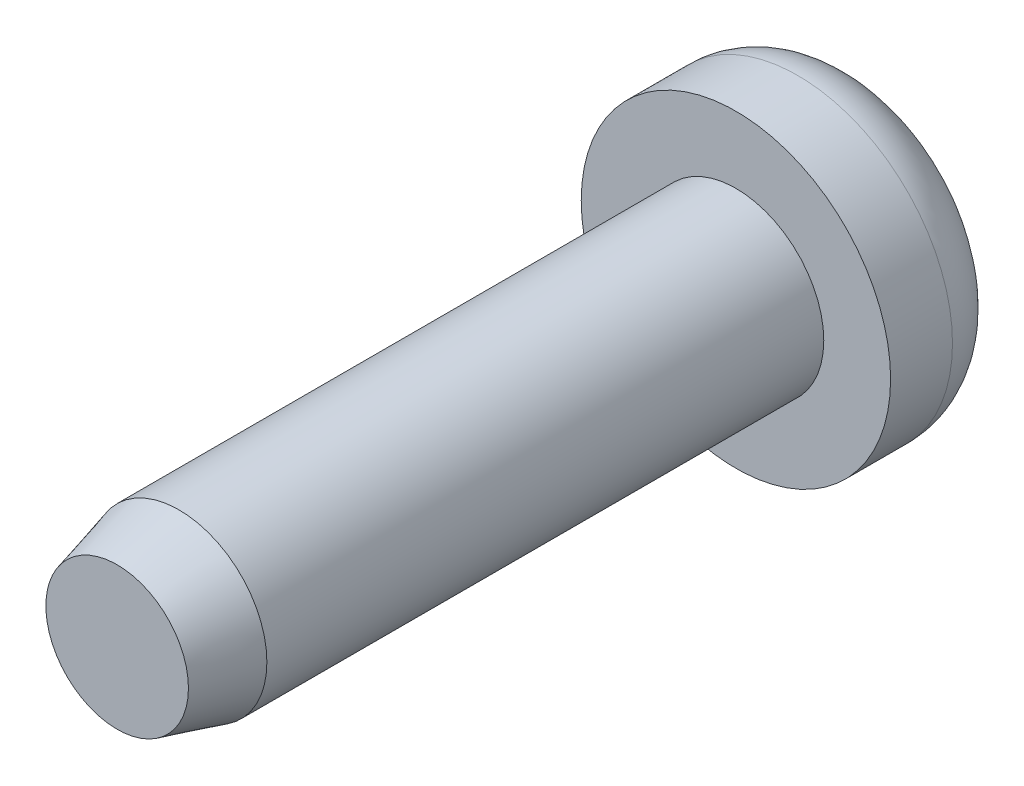
ISO-10303-21;
HEADER;
FILE_DESCRIPTION(('STEP AP214'),'2;1');
FILE_NAME('part.step','',(''),(''),'','','');
FILE_SCHEMA(('AUTOMOTIVE_DESIGN { 1 0 10303 214 1 1 1 1 }'));
ENDSEC;
DATA;
#1=APPLICATION_CONTEXT('core data for automotive mechanical design processes');
#2=APPLICATION_PROTOCOL_DEFINITION('international standard','automotive_design',2000,#1);
#3=PRODUCT_CONTEXT('',#1,'mechanical');
#4=PRODUCT('Part','Part','',(#3));
#5=PRODUCT_RELATED_PRODUCT_CATEGORY('part','',(#4));
#6=PRODUCT_DEFINITION_FORMATION('','',#4);
#7=PRODUCT_DEFINITION_CONTEXT('part definition',#1,'design');
#8=PRODUCT_DEFINITION('design','',#6,#7);
#9=PRODUCT_DEFINITION_SHAPE('','',#8);
#10=(LENGTH_UNIT() NAMED_UNIT(*) SI_UNIT(.MILLI.,.METRE.));
#11=(NAMED_UNIT(*) PLANE_ANGLE_UNIT() SI_UNIT($,.RADIAN.));
#12=(NAMED_UNIT(*) SI_UNIT($,.STERADIAN.) SOLID_ANGLE_UNIT());
#13=UNCERTAINTY_MEASURE_WITH_UNIT(LENGTH_MEASURE(1.E-05),#10,'distance_accuracy_value','');
#14=(GEOMETRIC_REPRESENTATION_CONTEXT(3) GLOBAL_UNCERTAINTY_ASSIGNED_CONTEXT((#13)) GLOBAL_UNIT_ASSIGNED_CONTEXT((#10,
#11,#12)) REPRESENTATION_CONTEXT('',''));
#15=CARTESIAN_POINT('',(0.,0.,0.));
#16=DIRECTION('',(0.,0.,1.));
#17=DIRECTION('',(1.,0.,0.));
#18=AXIS2_PLACEMENT_3D('',#15,#16,#17);
#19=CARTESIAN_POINT('',(0.,0.,6.35));
#20=DIRECTION('',(0.,0.,-1.));
#21=DIRECTION('',(-1.,0.,0.));
#22=AXIS2_PLACEMENT_3D('',#19,#20,#21);
#23=CYLINDRICAL_SURFACE('',#22,1.8034);
#24=CARTESIAN_POINT('',(0.,0.,5.07999999999999));
#25=DIRECTION('',(0.,0.,1.));
#26=DIRECTION('',(1.,0.,0.));
#27=AXIS2_PLACEMENT_3D('',#24,#25,#26);
#28=CIRCLE('',#27,1.8034);
#29=CARTESIAN_POINT('',(1.8034,0.,5.07999999999999));
#30=VERTEX_POINT('',#29);
#31=EDGE_CURVE('E10',#30,#30,#28,.F.);
#32=ORIENTED_EDGE('',*,*,#31,.T.);
#33=EDGE_LOOP('',(#32));
#34=FACE_BOUND('',#33,.T.);
#35=CARTESIAN_POINT('',(0.,0.,-6.35));
#36=DIRECTION('',(0.,0.,1.));
#37=DIRECTION('',(1.,0.,0.));
#38=AXIS2_PLACEMENT_3D('',#35,#36,#37);
#39=CIRCLE('',#38,1.8034);
#40=CARTESIAN_POINT('',(1.8034,0.,-6.35));
#41=VERTEX_POINT('',#40);
#42=EDGE_CURVE('E43',#41,#41,#39,.T.);
#43=ORIENTED_EDGE('',*,*,#42,.T.);
#44=EDGE_LOOP('',(#43));
#45=FACE_BOUND('',#44,.T.);
#46=ADVANCED_FACE('F32',(#34,#45),#23,.T.);
#47=CARTESIAN_POINT('',(0.,0.,6.35));
#48=DIRECTION('',(0.,0.,1.));
#49=DIRECTION('',(1.,0.,0.));
#50=AXIS2_PLACEMENT_3D('',#47,#48,#49);
#51=PLANE('',#50);
#52=CARTESIAN_POINT('',(0.,0.,6.35));
#53=DIRECTION('',(0.,0.,1.));
#54=DIRECTION('',(1.,0.,0.));
#55=AXIS2_PLACEMENT_3D('',#52,#53,#54);
#56=CIRCLE('',#55,1.46310452561247);
#57=CARTESIAN_POINT('',(1.46310452561247,0.,6.35));
#58=VERTEX_POINT('',#57);
#59=EDGE_CURVE('E39',#58,#58,#56,.T.);
#60=ORIENTED_EDGE('',*,*,#59,.T.);
#61=EDGE_LOOP('',(#60));
#62=FACE_BOUND('',#61,.T.);
#63=ADVANCED_FACE('F76',(#62),#51,.T.);
#64=CARTESIAN_POINT('',(0.,0.,6.35));
#65=DIRECTION('',(0.,0.,-1.));
#66=DIRECTION('',(-1.,0.,0.));
#67=AXIS2_PLACEMENT_3D('',#64,#65,#66);
#68=CONICAL_SURFACE('',#67,1.46310452561247,0.261799387799147);
#69=ORIENTED_EDGE('',*,*,#31,.F.);
#70=EDGE_LOOP('',(#69));
#71=FACE_BOUND('',#70,.T.);
#72=ORIENTED_EDGE('',*,*,#59,.F.);
#73=EDGE_LOOP('',(#72));
#74=FACE_BOUND('',#73,.T.);
#75=ADVANCED_FACE('F34',(#71,#74),#68,.T.);
#76=CARTESIAN_POINT('',(0.,0.,-8.89));
#77=DIRECTION('',(0.,0.,-1.));
#78=DIRECTION('',(-1.,0.,0.));
#79=AXIS2_PLACEMENT_3D('',#76,#77,#78);
#80=PLANE('',#79);
#81=CARTESIAN_POINT('',(0.,0.,-8.89));
#82=DIRECTION('',(0.,0.,1.));
#83=DIRECTION('',(1.,0.,0.));
#84=AXIS2_PLACEMENT_3D('',#81,#82,#83);
#85=CIRCLE('',#84,1.90499999999999);
#86=CARTESIAN_POINT('',(1.90499999999999,0.,-8.89));
#87=VERTEX_POINT('',#86);
#88=EDGE_CURVE('E47',#87,#87,#85,.T.);
#89=ORIENTED_EDGE('',*,*,#88,.F.);
#90=EDGE_LOOP('',(#89));
#91=FACE_BOUND('',#90,.T.);
#92=ADVANCED_FACE('F72',(#91),#80,.T.);
#93=CARTESIAN_POINT('',(0.,0.,-7.62));
#94=DIRECTION('',(0.,0.,1.));
#95=DIRECTION('',(1.,0.,0.));
#96=AXIS2_PLACEMENT_3D('',#93,#94,#95);
#97=TOROIDAL_SURFACE('',#96,1.905,1.27);
#98=ORIENTED_EDGE('',*,*,#88,.T.);
#99=EDGE_LOOP('',(#98));
#100=FACE_BOUND('',#99,.T.);
#101=CARTESIAN_POINT('',(0.,0.,-7.61999999999999));
#102=DIRECTION('',(0.,0.,1.));
#103=DIRECTION('',(1.,0.,0.));
#104=AXIS2_PLACEMENT_3D('',#101,#102,#103);
#105=CIRCLE('',#104,3.175);
#106=CARTESIAN_POINT('',(3.175,0.,-7.61999999999999));
#107=VERTEX_POINT('',#106);
#108=EDGE_CURVE('E52',#107,#107,#105,.T.);
#109=ORIENTED_EDGE('',*,*,#108,.F.);
#110=EDGE_LOOP('',(#109));
#111=FACE_BOUND('',#110,.T.);
#112=ADVANCED_FACE('F63',(#100,#111),#97,.T.);
#113=CARTESIAN_POINT('',(0.,0.,-6.35));
#114=DIRECTION('',(0.,0.,1.));
#115=DIRECTION('',(1.,0.,0.));
#116=AXIS2_PLACEMENT_3D('',#113,#114,#115);
#117=CYLINDRICAL_SURFACE('',#116,3.175);
#118=ORIENTED_EDGE('',*,*,#108,.T.);
#119=EDGE_LOOP('',(#118));
#120=FACE_BOUND('',#119,.T.);
#121=CARTESIAN_POINT('',(0.,0.,-6.35));
#122=DIRECTION('',(0.,0.,1.));
#123=DIRECTION('',(1.,0.,0.));
#124=AXIS2_PLACEMENT_3D('',#121,#122,#123);
#125=CIRCLE('',#124,3.175);
#126=CARTESIAN_POINT('',(3.175,0.,-6.35));
#127=VERTEX_POINT('',#126);
#128=EDGE_CURVE('E55',#127,#127,#125,.T.);
#129=ORIENTED_EDGE('',*,*,#128,.F.);
#130=EDGE_LOOP('',(#129));
#131=FACE_BOUND('',#130,.T.);
#132=ADVANCED_FACE('F61',(#120,#131),#117,.T.);
#133=CARTESIAN_POINT('',(0.,0.,-6.35));
#134=DIRECTION('',(0.,0.,1.));
#135=DIRECTION('',(1.,0.,0.));
#136=AXIS2_PLACEMENT_3D('',#133,#134,#135);
#137=PLANE('',#136);
#138=ORIENTED_EDGE('',*,*,#42,.F.);
#139=EDGE_LOOP('',(#138));
#140=FACE_BOUND('',#139,.T.);
#141=ORIENTED_EDGE('',*,*,#128,.T.);
#142=EDGE_LOOP('',(#141));
#143=FACE_BOUND('',#142,.T.);
#144=ADVANCED_FACE('F59',(#140,#143),#137,.T.);
#145=CLOSED_SHELL('',(#46,#63,#75,#92,#112,#132,#144));
#146=MANIFOLD_SOLID_BREP('B2',#145);
#147=ADVANCED_BREP_SHAPE_REPRESENTATION('',(#18,#146),#14);
#148=SHAPE_DEFINITION_REPRESENTATION(#9,#147);
ENDSEC;
END-ISO-10303-21;
